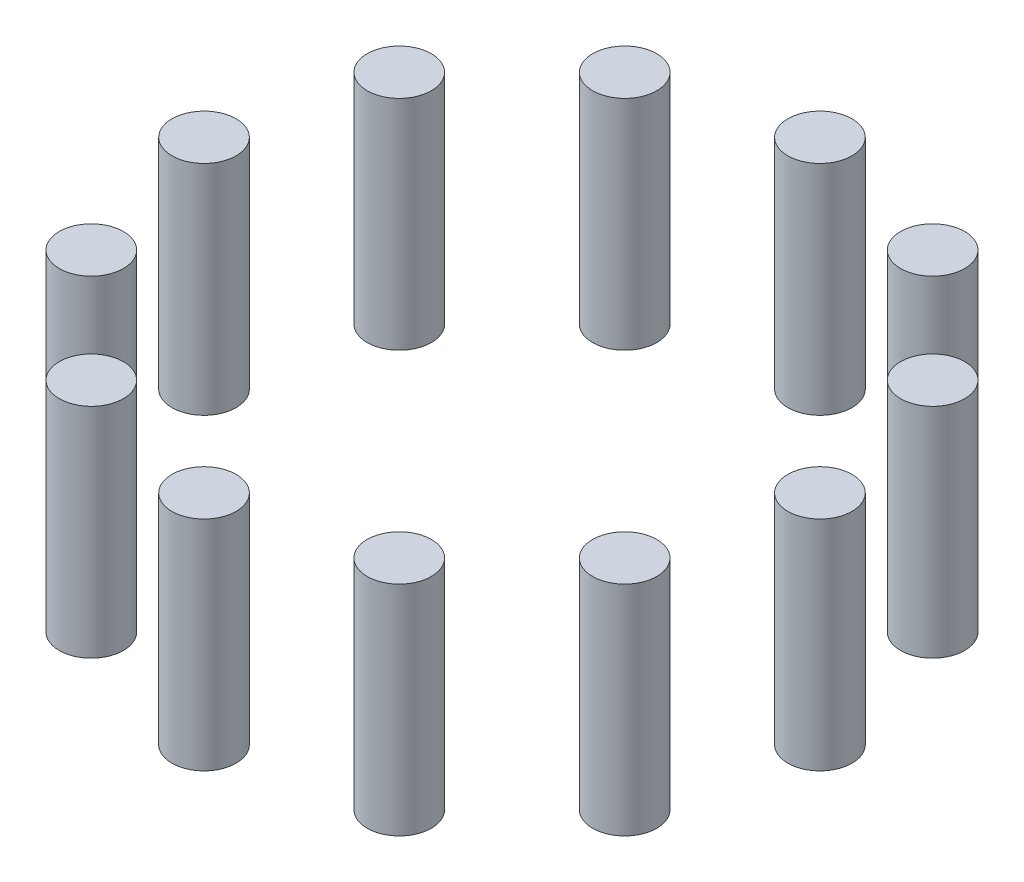
ISO-10303-21;
HEADER;
FILE_DESCRIPTION(('STEP AP214'),'2;1');
FILE_NAME('part.step','',(''),(''),'','','');
FILE_SCHEMA(('AUTOMOTIVE_DESIGN { 1 0 10303 214 1 1 1 1 }'));
ENDSEC;
DATA;
#1=APPLICATION_CONTEXT('core data for automotive mechanical design processes');
#2=APPLICATION_PROTOCOL_DEFINITION('international standard','automotive_design',2000,#1);
#3=PRODUCT_CONTEXT('',#1,'mechanical');
#4=PRODUCT('Part','Part','',(#3));
#5=PRODUCT_RELATED_PRODUCT_CATEGORY('part','',(#4));
#6=PRODUCT_DEFINITION_FORMATION('','',#4);
#7=PRODUCT_DEFINITION_CONTEXT('part definition',#1,'design');
#8=PRODUCT_DEFINITION('design','',#6,#7);
#9=PRODUCT_DEFINITION_SHAPE('','',#8);
#10=(LENGTH_UNIT() NAMED_UNIT(*) SI_UNIT(.MILLI.,.METRE.));
#11=(NAMED_UNIT(*) PLANE_ANGLE_UNIT() SI_UNIT($,.RADIAN.));
#12=(NAMED_UNIT(*) SI_UNIT($,.STERADIAN.) SOLID_ANGLE_UNIT());
#13=UNCERTAINTY_MEASURE_WITH_UNIT(LENGTH_MEASURE(1.E-05),#10,'distance_accuracy_value','');
#14=(GEOMETRIC_REPRESENTATION_CONTEXT(3) GLOBAL_UNCERTAINTY_ASSIGNED_CONTEXT((#13)) GLOBAL_UNIT_ASSIGNED_CONTEXT((#10,
#11,#12)) REPRESENTATION_CONTEXT('',''));
#15=CARTESIAN_POINT('',(0.,0.,0.));
#16=DIRECTION('',(0.,0.,1.));
#17=DIRECTION('',(1.,0.,0.));
#18=AXIS2_PLACEMENT_3D('',#15,#16,#17);
#19=CARTESIAN_POINT('',(-11.9999999999999,17.,-20.784609690826));
#20=DIRECTION('',(0.,-1.,0.));
#21=DIRECTION('',(0.,0.,-1.));
#22=AXIS2_PLACEMENT_3D('',#19,#20,#21);
#23=CYLINDRICAL_SURFACE('',#22,2.50000000000058);
#24=CARTESIAN_POINT('',(-11.9999999999999,17.,-20.784609690826));
#25=DIRECTION('',(0.,1.,0.));
#26=DIRECTION('',(0.,0.,1.));
#27=AXIS2_PLACEMENT_3D('',#24,#25,#26);
#28=CIRCLE('',#27,2.50000000000058);
#29=CARTESIAN_POINT('',(-11.9999999999999,17.,-18.2846096908254));
#30=VERTEX_POINT('',#29);
#31=EDGE_CURVE('E11',#30,#30,#28,.T.);
#32=ORIENTED_EDGE('',*,*,#31,.F.);
#33=EDGE_LOOP('',(#32));
#34=FACE_BOUND('',#33,.T.);
#35=CARTESIAN_POINT('',(-11.9999999999999,0.,-20.784609690826));
#36=DIRECTION('',(0.,1.,0.));
#37=DIRECTION('',(0.,0.,1.));
#38=AXIS2_PLACEMENT_3D('',#35,#36,#37);
#39=CIRCLE('',#38,2.50000000000058);
#40=CARTESIAN_POINT('',(-11.9999999999999,0.,-18.2846096908254));
#41=VERTEX_POINT('',#40);
#42=EDGE_CURVE('E43',#41,#41,#39,.T.);
#43=ORIENTED_EDGE('',*,*,#42,.T.);
#44=EDGE_LOOP('',(#43));
#45=FACE_BOUND('',#44,.T.);
#46=ADVANCED_FACE('F40',(#34,#45),#23,.T.);
#47=CARTESIAN_POINT('',(-11.9999999999999,17.,-20.784609690826));
#48=DIRECTION('',(0.,1.,0.));
#49=DIRECTION('',(0.,0.,1.));
#50=AXIS2_PLACEMENT_3D('',#47,#48,#49);
#51=PLANE('',#50);
#52=ORIENTED_EDGE('',*,*,#31,.T.);
#53=EDGE_LOOP('',(#52));
#54=FACE_BOUND('',#53,.T.);
#55=ADVANCED_FACE('F55',(#54),#51,.T.);
#56=CARTESIAN_POINT('',(-11.9999999999999,0.,-20.784609690826));
#57=DIRECTION('',(0.,1.,0.));
#58=DIRECTION('',(0.,0.,1.));
#59=AXIS2_PLACEMENT_3D('',#56,#57,#58);
#60=PLANE('',#59);
#61=ORIENTED_EDGE('',*,*,#42,.F.);
#62=EDGE_LOOP('',(#61));
#63=FACE_BOUND('',#62,.T.);
#64=ADVANCED_FACE('F53',(#63),#60,.F.);
#65=CLOSED_SHELL('',(#46,#55,#64));
#66=MANIFOLD_SOLID_BREP('B2',#65);
#67=CARTESIAN_POINT('',(-20.784609690826,17.,-11.9999999999991));
#68=DIRECTION('',(0.,-1.,0.));
#69=DIRECTION('',(0.,0.,-1.));
#70=AXIS2_PLACEMENT_3D('',#67,#68,#69);
#71=CYLINDRICAL_SURFACE('',#70,2.50000000000103);
#72=CARTESIAN_POINT('',(-20.784609690826,17.,-11.9999999999991));
#73=DIRECTION('',(0.,1.,0.));
#74=DIRECTION('',(0.,0.,1.));
#75=AXIS2_PLACEMENT_3D('',#72,#73,#74);
#76=CIRCLE('',#75,2.50000000000103);
#77=CARTESIAN_POINT('',(-20.784609690826,17.,-9.49999999999807));
#78=VERTEX_POINT('',#77);
#79=EDGE_CURVE('E39',#78,#78,#76,.T.);
#80=ORIENTED_EDGE('',*,*,#79,.F.);
#81=EDGE_LOOP('',(#80));
#82=FACE_BOUND('',#81,.T.);
#83=CARTESIAN_POINT('',(-20.784609690826,0.,-11.9999999999991));
#84=DIRECTION('',(0.,1.,0.));
#85=DIRECTION('',(0.,0.,1.));
#86=AXIS2_PLACEMENT_3D('',#83,#84,#85);
#87=CIRCLE('',#86,2.50000000000103);
#88=CARTESIAN_POINT('',(-20.784609690826,0.,-9.49999999999807));
#89=VERTEX_POINT('',#88);
#90=EDGE_CURVE('E92',#89,#89,#87,.T.);
#91=ORIENTED_EDGE('',*,*,#90,.T.);
#92=EDGE_LOOP('',(#91));
#93=FACE_BOUND('',#92,.T.);
#94=ADVANCED_FACE('F89',(#82,#93),#71,.T.);
#95=CARTESIAN_POINT('',(-20.784609690826,17.,-11.9999999999991));
#96=DIRECTION('',(0.,1.,0.));
#97=DIRECTION('',(0.,0.,1.));
#98=AXIS2_PLACEMENT_3D('',#95,#96,#97);
#99=PLANE('',#98);
#100=ORIENTED_EDGE('',*,*,#79,.T.);
#101=EDGE_LOOP('',(#100));
#102=FACE_BOUND('',#101,.T.);
#103=ADVANCED_FACE('F104',(#102),#99,.T.);
#104=CARTESIAN_POINT('',(-20.784609690826,0.,-11.9999999999991));
#105=DIRECTION('',(0.,1.,0.));
#106=DIRECTION('',(0.,0.,1.));
#107=AXIS2_PLACEMENT_3D('',#104,#105,#106);
#108=PLANE('',#107);
#109=ORIENTED_EDGE('',*,*,#90,.F.);
#110=EDGE_LOOP('',(#109));
#111=FACE_BOUND('',#110,.T.);
#112=ADVANCED_FACE('F102',(#111),#108,.F.);
#113=CLOSED_SHELL('',(#94,#103,#112));
#114=MANIFOLD_SOLID_BREP('B6',#113);
#115=CARTESIAN_POINT('',(-23.999999999999,17.,1.02171196333557E-12));
#116=DIRECTION('',(0.,-1.,0.));
#117=DIRECTION('',(0.,0.,-1.));
#118=AXIS2_PLACEMENT_3D('',#115,#116,#117);
#119=CYLINDRICAL_SURFACE('',#118,2.50000000000152);
#120=CARTESIAN_POINT('',(-23.999999999999,17.,1.02171196333557E-12));
#121=DIRECTION('',(0.,1.,0.));
#122=DIRECTION('',(0.,0.,1.));
#123=AXIS2_PLACEMENT_3D('',#120,#121,#122);
#124=CIRCLE('',#123,2.50000000000152);
#125=CARTESIAN_POINT('',(-23.999999999999,17.,2.50000000000254));
#126=VERTEX_POINT('',#125);
#127=EDGE_CURVE('E88',#126,#126,#124,.T.);
#128=ORIENTED_EDGE('',*,*,#127,.F.);
#129=EDGE_LOOP('',(#128));
#130=FACE_BOUND('',#129,.T.);
#131=CARTESIAN_POINT('',(-23.999999999999,0.,1.02171196333557E-12));
#132=DIRECTION('',(0.,1.,0.));
#133=DIRECTION('',(0.,0.,1.));
#134=AXIS2_PLACEMENT_3D('',#131,#132,#133);
#135=CIRCLE('',#134,2.50000000000152);
#136=CARTESIAN_POINT('',(-23.999999999999,0.,2.50000000000254));
#137=VERTEX_POINT('',#136);
#138=EDGE_CURVE('E141',#137,#137,#135,.T.);
#139=ORIENTED_EDGE('',*,*,#138,.T.);
#140=EDGE_LOOP('',(#139));
#141=FACE_BOUND('',#140,.T.);
#142=ADVANCED_FACE('F138',(#130,#141),#119,.T.);
#143=CARTESIAN_POINT('',(-23.999999999999,17.,1.02171196333557E-12));
#144=DIRECTION('',(0.,1.,0.));
#145=DIRECTION('',(0.,0.,1.));
#146=AXIS2_PLACEMENT_3D('',#143,#144,#145);
#147=PLANE('',#146);
#148=ORIENTED_EDGE('',*,*,#127,.T.);
#149=EDGE_LOOP('',(#148));
#150=FACE_BOUND('',#149,.T.);
#151=ADVANCED_FACE('F153',(#150),#147,.T.);
#152=CARTESIAN_POINT('',(-23.999999999999,0.,1.02171196333557E-12));
#153=DIRECTION('',(0.,1.,0.));
#154=DIRECTION('',(0.,0.,1.));
#155=AXIS2_PLACEMENT_3D('',#152,#153,#154);
#156=PLANE('',#155);
#157=ORIENTED_EDGE('',*,*,#138,.F.);
#158=EDGE_LOOP('',(#157));
#159=FACE_BOUND('',#158,.T.);
#160=ADVANCED_FACE('F151',(#159),#156,.F.);
#161=CLOSED_SHELL('',(#142,#151,#160));
#162=MANIFOLD_SOLID_BREP('B34',#161);
#163=CARTESIAN_POINT('',(-20.784609690825,17.,12.0000000000009));
#164=DIRECTION('',(0.,-1.,0.));
#165=DIRECTION('',(0.,0.,-1.));
#166=AXIS2_PLACEMENT_3D('',#163,#164,#165);
#167=CYLINDRICAL_SURFACE('',#166,2.50000000000194);
#168=CARTESIAN_POINT('',(-20.784609690825,17.,12.0000000000009));
#169=DIRECTION('',(0.,1.,0.));
#170=DIRECTION('',(0.,0.,1.));
#171=AXIS2_PLACEMENT_3D('',#168,#169,#170);
#172=CIRCLE('',#171,2.50000000000194);
#173=CARTESIAN_POINT('',(-20.784609690825,17.,14.5000000000028));
#174=VERTEX_POINT('',#173);
#175=EDGE_CURVE('E137',#174,#174,#172,.T.);
#176=ORIENTED_EDGE('',*,*,#175,.F.);
#177=EDGE_LOOP('',(#176));
#178=FACE_BOUND('',#177,.T.);
#179=CARTESIAN_POINT('',(-20.784609690825,0.,12.0000000000009));
#180=DIRECTION('',(0.,1.,0.));
#181=DIRECTION('',(0.,0.,1.));
#182=AXIS2_PLACEMENT_3D('',#179,#180,#181);
#183=CIRCLE('',#182,2.50000000000194);
#184=CARTESIAN_POINT('',(-20.784609690825,0.,14.5000000000028));
#185=VERTEX_POINT('',#184);
#186=EDGE_CURVE('E190',#185,#185,#183,.T.);
#187=ORIENTED_EDGE('',*,*,#186,.T.);
#188=EDGE_LOOP('',(#187));
#189=FACE_BOUND('',#188,.T.);
#190=ADVANCED_FACE('F187',(#178,#189),#167,.T.);
#191=CARTESIAN_POINT('',(-20.784609690825,17.,12.0000000000009));
#192=DIRECTION('',(0.,1.,0.));
#193=DIRECTION('',(0.,0.,1.));
#194=AXIS2_PLACEMENT_3D('',#191,#192,#193);
#195=PLANE('',#194);
#196=ORIENTED_EDGE('',*,*,#175,.T.);
#197=EDGE_LOOP('',(#196));
#198=FACE_BOUND('',#197,.T.);
#199=ADVANCED_FACE('F202',(#198),#195,.T.);
#200=CARTESIAN_POINT('',(-20.784609690825,0.,12.0000000000009));
#201=DIRECTION('',(0.,1.,0.));
#202=DIRECTION('',(0.,0.,1.));
#203=AXIS2_PLACEMENT_3D('',#200,#201,#202);
#204=PLANE('',#203);
#205=ORIENTED_EDGE('',*,*,#186,.F.);
#206=EDGE_LOOP('',(#205));
#207=FACE_BOUND('',#206,.T.);
#208=ADVANCED_FACE('F200',(#207),#204,.F.);
#209=CLOSED_SHELL('',(#190,#199,#208));
#210=MANIFOLD_SOLID_BREP('B83',#209);
#211=CARTESIAN_POINT('',(-11.9999999999981,17.,20.784609690827));
#212=DIRECTION('',(0.,-1.,0.));
#213=DIRECTION('',(0.,0.,-1.));
#214=AXIS2_PLACEMENT_3D('',#211,#212,#213);
#215=CYLINDRICAL_SURFACE('',#214,2.50000000000216);
#216=CARTESIAN_POINT('',(-11.9999999999981,17.,20.784609690827));
#217=DIRECTION('',(0.,1.,0.));
#218=DIRECTION('',(0.,0.,1.));
#219=AXIS2_PLACEMENT_3D('',#216,#217,#218);
#220=CIRCLE('',#219,2.50000000000216);
#221=CARTESIAN_POINT('',(-11.9999999999981,17.,23.2846096908292));
#222=VERTEX_POINT('',#221);
#223=EDGE_CURVE('E186',#222,#222,#220,.T.);
#224=ORIENTED_EDGE('',*,*,#223,.F.);
#225=EDGE_LOOP('',(#224));
#226=FACE_BOUND('',#225,.T.);
#227=CARTESIAN_POINT('',(-11.9999999999981,0.,20.784609690827));
#228=DIRECTION('',(0.,1.,0.));
#229=DIRECTION('',(0.,0.,1.));
#230=AXIS2_PLACEMENT_3D('',#227,#228,#229);
#231=CIRCLE('',#230,2.50000000000216);
#232=CARTESIAN_POINT('',(-11.9999999999981,0.,23.2846096908292));
#233=VERTEX_POINT('',#232);
#234=EDGE_CURVE('E239',#233,#233,#231,.T.);
#235=ORIENTED_EDGE('',*,*,#234,.T.);
#236=EDGE_LOOP('',(#235));
#237=FACE_BOUND('',#236,.T.);
#238=ADVANCED_FACE('F236',(#226,#237),#215,.T.);
#239=CARTESIAN_POINT('',(-11.9999999999981,17.,20.784609690827));
#240=DIRECTION('',(0.,1.,0.));
#241=DIRECTION('',(0.,0.,1.));
#242=AXIS2_PLACEMENT_3D('',#239,#240,#241);
#243=PLANE('',#242);
#244=ORIENTED_EDGE('',*,*,#223,.T.);
#245=EDGE_LOOP('',(#244));
#246=FACE_BOUND('',#245,.T.);
#247=ADVANCED_FACE('F251',(#246),#243,.T.);
#248=CARTESIAN_POINT('',(-11.9999999999981,0.,20.784609690827));
#249=DIRECTION('',(0.,1.,0.));
#250=DIRECTION('',(0.,0.,1.));
#251=AXIS2_PLACEMENT_3D('',#248,#249,#250);
#252=PLANE('',#251);
#253=ORIENTED_EDGE('',*,*,#234,.F.);
#254=EDGE_LOOP('',(#253));
#255=FACE_BOUND('',#254,.T.);
#256=ADVANCED_FACE('F249',(#255),#252,.F.);
#257=CLOSED_SHELL('',(#238,#247,#256));
#258=MANIFOLD_SOLID_BREP('B132',#257);
#259=CARTESIAN_POINT('',(2.03754562203523E-12,17.,24.));
#260=DIRECTION('',(0.,-1.,0.));
#261=DIRECTION('',(0.,0.,-1.));
#262=AXIS2_PLACEMENT_3D('',#259,#260,#261);
#263=CYLINDRICAL_SURFACE('',#262,2.50000000000211);
#264=CARTESIAN_POINT('',(2.03754562203523E-12,17.,24.));
#265=DIRECTION('',(0.,1.,0.));
#266=DIRECTION('',(0.,0.,1.));
#267=AXIS2_PLACEMENT_3D('',#264,#265,#266);
#268=CIRCLE('',#267,2.50000000000211);
#269=CARTESIAN_POINT('',(2.03754562203523E-12,17.,26.5000000000021));
#270=VERTEX_POINT('',#269);
#271=EDGE_CURVE('E235',#270,#270,#268,.T.);
#272=ORIENTED_EDGE('',*,*,#271,.F.);
#273=EDGE_LOOP('',(#272));
#274=FACE_BOUND('',#273,.T.);
#275=CARTESIAN_POINT('',(2.03754562203523E-12,0.,24.));
#276=DIRECTION('',(0.,1.,0.));
#277=DIRECTION('',(0.,0.,1.));
#278=AXIS2_PLACEMENT_3D('',#275,#276,#277);
#279=CIRCLE('',#278,2.50000000000211);
#280=CARTESIAN_POINT('',(2.03754562203523E-12,0.,26.5000000000021));
#281=VERTEX_POINT('',#280);
#282=EDGE_CURVE('E288',#281,#281,#279,.T.);
#283=ORIENTED_EDGE('',*,*,#282,.T.);
#284=EDGE_LOOP('',(#283));
#285=FACE_BOUND('',#284,.T.);
#286=ADVANCED_FACE('F285',(#274,#285),#263,.T.);
#287=CARTESIAN_POINT('',(2.03754562203523E-12,17.,24.));
#288=DIRECTION('',(0.,1.,0.));
#289=DIRECTION('',(0.,0.,1.));
#290=AXIS2_PLACEMENT_3D('',#287,#288,#289);
#291=PLANE('',#290);
#292=ORIENTED_EDGE('',*,*,#271,.T.);
#293=EDGE_LOOP('',(#292));
#294=FACE_BOUND('',#293,.T.);
#295=ADVANCED_FACE('F300',(#294),#291,.T.);
#296=CARTESIAN_POINT('',(2.03754562203523E-12,0.,24.));
#297=DIRECTION('',(0.,1.,0.));
#298=DIRECTION('',(0.,0.,1.));
#299=AXIS2_PLACEMENT_3D('',#296,#297,#298);
#300=PLANE('',#299);
#301=ORIENTED_EDGE('',*,*,#282,.F.);
#302=EDGE_LOOP('',(#301));
#303=FACE_BOUND('',#302,.T.);
#304=ADVANCED_FACE('F298',(#303),#300,.F.);
#305=CLOSED_SHELL('',(#286,#295,#304));
#306=MANIFOLD_SOLID_BREP('B181',#305);
#307=CARTESIAN_POINT('',(12.0000000000019,17.,20.784609690826));
#308=DIRECTION('',(0.,-1.,0.));
#309=DIRECTION('',(0.,0.,-1.));
#310=AXIS2_PLACEMENT_3D('',#307,#308,#309);
#311=CYLINDRICAL_SURFACE('',#310,2.50000000000182);
#312=CARTESIAN_POINT('',(12.0000000000019,17.,20.784609690826));
#313=DIRECTION('',(0.,1.,0.));
#314=DIRECTION('',(0.,0.,1.));
#315=AXIS2_PLACEMENT_3D('',#312,#313,#314);
#316=CIRCLE('',#315,2.50000000000182);
#317=CARTESIAN_POINT('',(12.0000000000019,17.,23.2846096908278));
#318=VERTEX_POINT('',#317);
#319=EDGE_CURVE('E284',#318,#318,#316,.T.);
#320=ORIENTED_EDGE('',*,*,#319,.F.);
#321=EDGE_LOOP('',(#320));
#322=FACE_BOUND('',#321,.T.);
#323=CARTESIAN_POINT('',(12.0000000000019,0.,20.784609690826));
#324=DIRECTION('',(0.,1.,0.));
#325=DIRECTION('',(0.,0.,1.));
#326=AXIS2_PLACEMENT_3D('',#323,#324,#325);
#327=CIRCLE('',#326,2.50000000000182);
#328=CARTESIAN_POINT('',(12.0000000000019,0.,23.2846096908278));
#329=VERTEX_POINT('',#328);
#330=EDGE_CURVE('E337',#329,#329,#327,.T.);
#331=ORIENTED_EDGE('',*,*,#330,.T.);
#332=EDGE_LOOP('',(#331));
#333=FACE_BOUND('',#332,.T.);
#334=ADVANCED_FACE('F334',(#322,#333),#311,.T.);
#335=CARTESIAN_POINT('',(12.0000000000019,17.,20.784609690826));
#336=DIRECTION('',(0.,1.,0.));
#337=DIRECTION('',(0.,0.,1.));
#338=AXIS2_PLACEMENT_3D('',#335,#336,#337);
#339=PLANE('',#338);
#340=ORIENTED_EDGE('',*,*,#319,.T.);
#341=EDGE_LOOP('',(#340));
#342=FACE_BOUND('',#341,.T.);
#343=ADVANCED_FACE('F349',(#342),#339,.T.);
#344=CARTESIAN_POINT('',(12.0000000000019,0.,20.784609690826));
#345=DIRECTION('',(0.,1.,0.));
#346=DIRECTION('',(0.,0.,1.));
#347=AXIS2_PLACEMENT_3D('',#344,#345,#346);
#348=PLANE('',#347);
#349=ORIENTED_EDGE('',*,*,#330,.F.);
#350=EDGE_LOOP('',(#349));
#351=FACE_BOUND('',#350,.T.);
#352=ADVANCED_FACE('F347',(#351),#348,.F.);
#353=CLOSED_SHELL('',(#334,#343,#352));
#354=MANIFOLD_SOLID_BREP('B230',#353);
#355=CARTESIAN_POINT('',(20.7846096908281,17.,11.9999999999991));
#356=DIRECTION('',(0.,-1.,0.));
#357=DIRECTION('',(0.,0.,-1.));
#358=AXIS2_PLACEMENT_3D('',#355,#356,#357);
#359=CYLINDRICAL_SURFACE('',#358,2.50000000000131);
#360=CARTESIAN_POINT('',(20.7846096908281,17.,11.9999999999991));
#361=DIRECTION('',(0.,1.,0.));
#362=DIRECTION('',(0.,0.,1.));
#363=AXIS2_PLACEMENT_3D('',#360,#361,#362);
#364=CIRCLE('',#363,2.50000000000131);
#365=CARTESIAN_POINT('',(20.7846096908281,17.,14.5000000000004));
#366=VERTEX_POINT('',#365);
#367=EDGE_CURVE('E333',#366,#366,#364,.T.);
#368=ORIENTED_EDGE('',*,*,#367,.F.);
#369=EDGE_LOOP('',(#368));
#370=FACE_BOUND('',#369,.T.);
#371=CARTESIAN_POINT('',(20.7846096908281,0.,11.9999999999991));
#372=DIRECTION('',(0.,1.,0.));
#373=DIRECTION('',(0.,0.,1.));
#374=AXIS2_PLACEMENT_3D('',#371,#372,#373);
#375=CIRCLE('',#374,2.50000000000131);
#376=CARTESIAN_POINT('',(20.7846096908281,0.,14.5000000000004));
#377=VERTEX_POINT('',#376);
#378=EDGE_CURVE('E386',#377,#377,#375,.T.);
#379=ORIENTED_EDGE('',*,*,#378,.T.);
#380=EDGE_LOOP('',(#379));
#381=FACE_BOUND('',#380,.T.);
#382=ADVANCED_FACE('F383',(#370,#381),#359,.T.);
#383=CARTESIAN_POINT('',(20.7846096908281,17.,11.9999999999991));
#384=DIRECTION('',(0.,1.,0.));
#385=DIRECTION('',(0.,0.,1.));
#386=AXIS2_PLACEMENT_3D('',#383,#384,#385);
#387=PLANE('',#386);
#388=ORIENTED_EDGE('',*,*,#367,.T.);
#389=EDGE_LOOP('',(#388));
#390=FACE_BOUND('',#389,.T.);
#391=ADVANCED_FACE('F398',(#390),#387,.T.);
#392=CARTESIAN_POINT('',(20.7846096908281,0.,11.9999999999991));
#393=DIRECTION('',(0.,1.,0.));
#394=DIRECTION('',(0.,0.,1.));
#395=AXIS2_PLACEMENT_3D('',#392,#393,#394);
#396=PLANE('',#395);
#397=ORIENTED_EDGE('',*,*,#378,.F.);
#398=EDGE_LOOP('',(#397));
#399=FACE_BOUND('',#398,.T.);
#400=ADVANCED_FACE('F396',(#399),#396,.F.);
#401=CLOSED_SHELL('',(#382,#391,#400));
#402=MANIFOLD_SOLID_BREP('B279',#401);
#403=CARTESIAN_POINT('',(24.000000000001,17.,-1.01877281101761E-12));
#404=DIRECTION('',(0.,-1.,0.));
#405=DIRECTION('',(0.,0.,-1.));
#406=AXIS2_PLACEMENT_3D('',#403,#404,#405);
#407=CYLINDRICAL_SURFACE('',#406,2.50000000000076);
#408=CARTESIAN_POINT('',(24.000000000001,17.,-1.01877281101761E-12));
#409=DIRECTION('',(0.,1.,0.));
#410=DIRECTION('',(0.,0.,1.));
#411=AXIS2_PLACEMENT_3D('',#408,#409,#410);
#412=CIRCLE('',#411,2.50000000000076);
#413=CARTESIAN_POINT('',(24.000000000001,17.,2.49999999999974));
#414=VERTEX_POINT('',#413);
#415=EDGE_CURVE('E382',#414,#414,#412,.T.);
#416=ORIENTED_EDGE('',*,*,#415,.F.);
#417=EDGE_LOOP('',(#416));
#418=FACE_BOUND('',#417,.T.);
#419=CARTESIAN_POINT('',(24.000000000001,0.,-1.01877281101761E-12));
#420=DIRECTION('',(0.,1.,0.));
#421=DIRECTION('',(0.,0.,1.));
#422=AXIS2_PLACEMENT_3D('',#419,#420,#421);
#423=CIRCLE('',#422,2.50000000000076);
#424=CARTESIAN_POINT('',(24.000000000001,0.,2.49999999999974));
#425=VERTEX_POINT('',#424);
#426=EDGE_CURVE('E435',#425,#425,#423,.T.);
#427=ORIENTED_EDGE('',*,*,#426,.T.);
#428=EDGE_LOOP('',(#427));
#429=FACE_BOUND('',#428,.T.);
#430=ADVANCED_FACE('F432',(#418,#429),#407,.T.);
#431=CARTESIAN_POINT('',(24.000000000001,17.,-1.01877281101761E-12));
#432=DIRECTION('',(0.,1.,0.));
#433=DIRECTION('',(0.,0.,1.));
#434=AXIS2_PLACEMENT_3D('',#431,#432,#433);
#435=PLANE('',#434);
#436=ORIENTED_EDGE('',*,*,#415,.T.);
#437=EDGE_LOOP('',(#436));
#438=FACE_BOUND('',#437,.T.);
#439=ADVANCED_FACE('F447',(#438),#435,.T.);
#440=CARTESIAN_POINT('',(24.000000000001,0.,-1.01877281101761E-12));
#441=DIRECTION('',(0.,1.,0.));
#442=DIRECTION('',(0.,0.,1.));
#443=AXIS2_PLACEMENT_3D('',#440,#441,#442);
#444=PLANE('',#443);
#445=ORIENTED_EDGE('',*,*,#426,.F.);
#446=EDGE_LOOP('',(#445));
#447=FACE_BOUND('',#446,.T.);
#448=ADVANCED_FACE('F445',(#447),#444,.F.);
#449=CLOSED_SHELL('',(#430,#439,#448));
#450=MANIFOLD_SOLID_BREP('B328',#449);
#451=CARTESIAN_POINT('',(20.784609690827,17.,-12.0000000000009));
#452=DIRECTION('',(0.,-1.,0.));
#453=DIRECTION('',(0.,0.,-1.));
#454=AXIS2_PLACEMENT_3D('',#451,#452,#453);
#455=CYLINDRICAL_SURFACE('',#454,2.50000000000029);
#456=CARTESIAN_POINT('',(20.784609690827,17.,-12.0000000000009));
#457=DIRECTION('',(0.,1.,0.));
#458=DIRECTION('',(0.,0.,1.));
#459=AXIS2_PLACEMENT_3D('',#456,#457,#458);
#460=CIRCLE('',#459,2.50000000000029);
#461=CARTESIAN_POINT('',(20.784609690827,17.,-9.5000000000006));
#462=VERTEX_POINT('',#461);
#463=EDGE_CURVE('E431',#462,#462,#460,.T.);
#464=ORIENTED_EDGE('',*,*,#463,.F.);
#465=EDGE_LOOP('',(#464));
#466=FACE_BOUND('',#465,.T.);
#467=CARTESIAN_POINT('',(20.784609690827,0.,-12.0000000000009));
#468=DIRECTION('',(0.,1.,0.));
#469=DIRECTION('',(0.,0.,1.));
#470=AXIS2_PLACEMENT_3D('',#467,#468,#469);
#471=CIRCLE('',#470,2.50000000000029);
#472=CARTESIAN_POINT('',(20.784609690827,0.,-9.5000000000006));
#473=VERTEX_POINT('',#472);
#474=EDGE_CURVE('E484',#473,#473,#471,.T.);
#475=ORIENTED_EDGE('',*,*,#474,.T.);
#476=EDGE_LOOP('',(#475));
#477=FACE_BOUND('',#476,.T.);
#478=ADVANCED_FACE('F481',(#466,#477),#455,.T.);
#479=CARTESIAN_POINT('',(20.784609690827,17.,-12.0000000000009));
#480=DIRECTION('',(0.,1.,0.));
#481=DIRECTION('',(0.,0.,1.));
#482=AXIS2_PLACEMENT_3D('',#479,#480,#481);
#483=PLANE('',#482);
#484=ORIENTED_EDGE('',*,*,#463,.T.);
#485=EDGE_LOOP('',(#484));
#486=FACE_BOUND('',#485,.T.);
#487=ADVANCED_FACE('F496',(#486),#483,.T.);
#488=CARTESIAN_POINT('',(20.784609690827,0.,-12.0000000000009));
#489=DIRECTION('',(0.,1.,0.));
#490=DIRECTION('',(0.,0.,1.));
#491=AXIS2_PLACEMENT_3D('',#488,#489,#490);
#492=PLANE('',#491);
#493=ORIENTED_EDGE('',*,*,#474,.F.);
#494=EDGE_LOOP('',(#493));
#495=FACE_BOUND('',#494,.T.);
#496=ADVANCED_FACE('F494',(#495),#492,.F.);
#497=CLOSED_SHELL('',(#478,#487,#496));
#498=MANIFOLD_SOLID_BREP('B377',#497);
#499=CARTESIAN_POINT('',(12.,17.,-20.7846096908265));
#500=DIRECTION('',(0.,-1.,0.));
#501=DIRECTION('',(0.,0.,-1.));
#502=AXIS2_PLACEMENT_3D('',#499,#500,#501);
#503=CYLINDRICAL_SURFACE('',#502,2.5);
#504=CARTESIAN_POINT('',(12.,17.,-20.7846096908265));
#505=DIRECTION('',(0.,1.,0.));
#506=DIRECTION('',(0.,0.,1.));
#507=AXIS2_PLACEMENT_3D('',#504,#505,#506);
#508=CIRCLE('',#507,2.5);
#509=CARTESIAN_POINT('',(12.,17.,-18.2846096908265));
#510=VERTEX_POINT('',#509);
#511=EDGE_CURVE('E480',#510,#510,#508,.T.);
#512=ORIENTED_EDGE('',*,*,#511,.F.);
#513=EDGE_LOOP('',(#512));
#514=FACE_BOUND('',#513,.T.);
#515=CARTESIAN_POINT('',(12.,0.,-20.7846096908265));
#516=DIRECTION('',(0.,1.,0.));
#517=DIRECTION('',(0.,0.,1.));
#518=AXIS2_PLACEMENT_3D('',#515,#516,#517);
#519=CIRCLE('',#518,2.5);
#520=CARTESIAN_POINT('',(12.,0.,-18.2846096908265));
#521=VERTEX_POINT('',#520);
#522=EDGE_CURVE('E532',#521,#521,#519,.T.);
#523=ORIENTED_EDGE('',*,*,#522,.T.);
#524=EDGE_LOOP('',(#523));
#525=FACE_BOUND('',#524,.T.);
#526=ADVANCED_FACE('F529',(#514,#525),#503,.T.);
#527=CARTESIAN_POINT('',(12.,17.,-20.7846096908265));
#528=DIRECTION('',(0.,1.,0.));
#529=DIRECTION('',(0.,0.,1.));
#530=AXIS2_PLACEMENT_3D('',#527,#528,#529);
#531=PLANE('',#530);
#532=ORIENTED_EDGE('',*,*,#511,.T.);
#533=EDGE_LOOP('',(#532));
#534=FACE_BOUND('',#533,.T.);
#535=ADVANCED_FACE('F544',(#534),#531,.T.);
#536=CARTESIAN_POINT('',(12.,0.,-20.7846096908265));
#537=DIRECTION('',(0.,1.,0.));
#538=DIRECTION('',(0.,0.,1.));
#539=AXIS2_PLACEMENT_3D('',#536,#537,#538);
#540=PLANE('',#539);
#541=ORIENTED_EDGE('',*,*,#522,.F.);
#542=EDGE_LOOP('',(#541));
#543=FACE_BOUND('',#542,.T.);
#544=ADVANCED_FACE('F542',(#543),#540,.F.);
#545=CLOSED_SHELL('',(#526,#535,#544));
#546=MANIFOLD_SOLID_BREP('B426',#545);
#547=CARTESIAN_POINT('',(0.,17.,-24.));
#548=DIRECTION('',(0.,-1.,0.));
#549=DIRECTION('',(0.,0.,-1.));
#550=AXIS2_PLACEMENT_3D('',#547,#548,#549);
#551=CYLINDRICAL_SURFACE('',#550,2.5);
#552=CARTESIAN_POINT('',(0.,17.,-24.));
#553=DIRECTION('',(0.,1.,0.));
#554=DIRECTION('',(0.,0.,1.));
#555=AXIS2_PLACEMENT_3D('',#552,#553,#554);
#556=CIRCLE('',#555,2.5);
#557=CARTESIAN_POINT('',(0.,17.,-21.5));
#558=VERTEX_POINT('',#557);
#559=EDGE_CURVE('E528',#558,#558,#556,.T.);
#560=ORIENTED_EDGE('',*,*,#559,.F.);
#561=EDGE_LOOP('',(#560));
#562=FACE_BOUND('',#561,.T.);
#563=CARTESIAN_POINT('',(0.,0.,-24.));
#564=DIRECTION('',(0.,1.,0.));
#565=DIRECTION('',(0.,0.,1.));
#566=AXIS2_PLACEMENT_3D('',#563,#564,#565);
#567=CIRCLE('',#566,2.5);
#568=CARTESIAN_POINT('',(0.,0.,-21.5));
#569=VERTEX_POINT('',#568);
#570=EDGE_CURVE('E573',#569,#569,#567,.T.);
#571=ORIENTED_EDGE('',*,*,#570,.T.);
#572=EDGE_LOOP('',(#571));
#573=FACE_BOUND('',#572,.T.);
#574=ADVANCED_FACE('F570',(#562,#573),#551,.T.);
#575=CARTESIAN_POINT('',(0.,17.,-24.));
#576=DIRECTION('',(0.,1.,0.));
#577=DIRECTION('',(0.,0.,1.));
#578=AXIS2_PLACEMENT_3D('',#575,#576,#577);
#579=PLANE('',#578);
#580=ORIENTED_EDGE('',*,*,#559,.T.);
#581=EDGE_LOOP('',(#580));
#582=FACE_BOUND('',#581,.T.);
#583=ADVANCED_FACE('F585',(#582),#579,.T.);
#584=CARTESIAN_POINT('',(0.,0.,-24.));
#585=DIRECTION('',(0.,1.,0.));
#586=DIRECTION('',(0.,0.,1.));
#587=AXIS2_PLACEMENT_3D('',#584,#585,#586);
#588=PLANE('',#587);
#589=ORIENTED_EDGE('',*,*,#570,.F.);
#590=EDGE_LOOP('',(#589));
#591=FACE_BOUND('',#590,.T.);
#592=ADVANCED_FACE('F583',(#591),#588,.F.);
#593=CLOSED_SHELL('',(#574,#583,#592));
#594=MANIFOLD_SOLID_BREP('B475',#593);
#595=ADVANCED_BREP_SHAPE_REPRESENTATION('',(#18,#66,#114,#162,#210,#258,#306,#354,#402,#450,
#498,#546,#594),#14);
#596=SHAPE_DEFINITION_REPRESENTATION(#9,#595);
ENDSEC;
END-ISO-10303-21;
